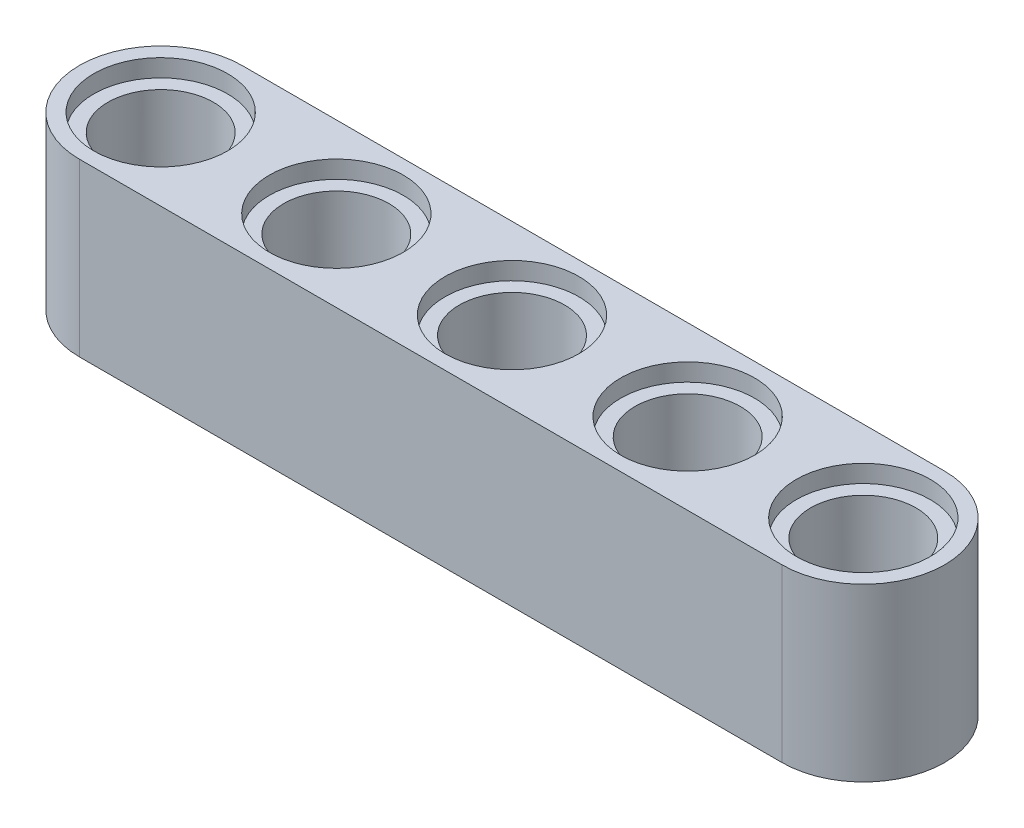
ISO-10303-21;
HEADER;
FILE_DESCRIPTION(('STEP AP214'),'2;1');
FILE_NAME('part.step','',(''),(''),'','','');
FILE_SCHEMA(('AUTOMOTIVE_DESIGN { 1 0 10303 214 1 1 1 1 }'));
ENDSEC;
DATA;
#1=APPLICATION_CONTEXT('core data for automotive mechanical design processes');
#2=APPLICATION_PROTOCOL_DEFINITION('international standard','automotive_design',2000,#1);
#3=PRODUCT_CONTEXT('',#1,'mechanical');
#4=PRODUCT('Part','Part','',(#3));
#5=PRODUCT_RELATED_PRODUCT_CATEGORY('part','',(#4));
#6=PRODUCT_DEFINITION_FORMATION('','',#4);
#7=PRODUCT_DEFINITION_CONTEXT('part definition',#1,'design');
#8=PRODUCT_DEFINITION('design','',#6,#7);
#9=PRODUCT_DEFINITION_SHAPE('','',#8);
#10=(LENGTH_UNIT() NAMED_UNIT(*) SI_UNIT(.MILLI.,.METRE.));
#11=(NAMED_UNIT(*) PLANE_ANGLE_UNIT() SI_UNIT($,.RADIAN.));
#12=(NAMED_UNIT(*) SI_UNIT($,.STERADIAN.) SOLID_ANGLE_UNIT());
#13=UNCERTAINTY_MEASURE_WITH_UNIT(LENGTH_MEASURE(1.E-05),#10,'distance_accuracy_value','');
#14=(GEOMETRIC_REPRESENTATION_CONTEXT(3) GLOBAL_UNCERTAINTY_ASSIGNED_CONTEXT((#13)) GLOBAL_UNIT_ASSIGNED_CONTEXT((#10,
#11,#12)) REPRESENTATION_CONTEXT('',''));
#15=CARTESIAN_POINT('',(0.,0.,0.));
#16=DIRECTION('',(0.,0.,1.));
#17=DIRECTION('',(1.,0.,0.));
#18=AXIS2_PLACEMENT_3D('',#15,#16,#17);
#19=CARTESIAN_POINT('',(8.,0.,0.));
#20=DIRECTION('',(0.,1.,0.));
#21=DIRECTION('',(0.,0.,1.));
#22=AXIS2_PLACEMENT_3D('',#19,#20,#21);
#23=CYLINDRICAL_SURFACE('',#22,2.4);
#24=CARTESIAN_POINT('',(8.,7.,0.));
#25=DIRECTION('',(0.,1.,0.));
#26=DIRECTION('',(0.,0.,1.));
#27=AXIS2_PLACEMENT_3D('',#24,#25,#26);
#28=CIRCLE('',#27,2.4);
#29=CARTESIAN_POINT('',(8.,7.,2.4));
#30=VERTEX_POINT('',#29);
#31=EDGE_CURVE('E123',#30,#30,#28,.F.);
#32=ORIENTED_EDGE('',*,*,#31,.F.);
#33=EDGE_LOOP('',(#32));
#34=FACE_BOUND('',#33,.T.);
#35=CARTESIAN_POINT('',(8.,0.8,0.));
#36=DIRECTION('',(0.,-1.,0.));
#37=DIRECTION('',(0.,0.,-1.));
#38=AXIS2_PLACEMENT_3D('',#35,#36,#37);
#39=CIRCLE('',#38,2.4);
#40=CARTESIAN_POINT('',(8.,0.8,-2.4));
#41=VERTEX_POINT('',#40);
#42=EDGE_CURVE('E40',#41,#41,#39,.F.);
#43=ORIENTED_EDGE('',*,*,#42,.F.);
#44=EDGE_LOOP('',(#43));
#45=FACE_BOUND('',#44,.T.);
#46=ADVANCED_FACE('F36',(#34,#45),#23,.F.);
#47=CARTESIAN_POINT('',(0.,0.,0.));
#48=DIRECTION('',(0.,1.,0.));
#49=DIRECTION('',(0.,0.,1.));
#50=AXIS2_PLACEMENT_3D('',#47,#48,#49);
#51=CYLINDRICAL_SURFACE('',#50,2.4);
#52=CARTESIAN_POINT('',(0.,7.,0.));
#53=DIRECTION('',(0.,1.,0.));
#54=DIRECTION('',(0.,0.,1.));
#55=AXIS2_PLACEMENT_3D('',#52,#53,#54);
#56=CIRCLE('',#55,2.4);
#57=CARTESIAN_POINT('',(0.,7.,2.4));
#58=VERTEX_POINT('',#57);
#59=EDGE_CURVE('E120',#58,#58,#56,.F.);
#60=ORIENTED_EDGE('',*,*,#59,.F.);
#61=EDGE_LOOP('',(#60));
#62=FACE_BOUND('',#61,.T.);
#63=CARTESIAN_POINT('',(0.,0.8,0.));
#64=DIRECTION('',(0.,-1.,0.));
#65=DIRECTION('',(0.,0.,-1.));
#66=AXIS2_PLACEMENT_3D('',#63,#64,#65);
#67=CIRCLE('',#66,2.4);
#68=CARTESIAN_POINT('',(0.,0.8,-2.4));
#69=VERTEX_POINT('',#68);
#70=EDGE_CURVE('E137',#69,#69,#67,.F.);
#71=ORIENTED_EDGE('',*,*,#70,.F.);
#72=EDGE_LOOP('',(#71));
#73=FACE_BOUND('',#72,.T.);
#74=ADVANCED_FACE('F214',(#62,#73),#51,.F.);
#75=CARTESIAN_POINT('',(-16.,0.,0.));
#76=DIRECTION('',(0.,1.,0.));
#77=DIRECTION('',(0.,0.,1.));
#78=AXIS2_PLACEMENT_3D('',#75,#76,#77);
#79=CYLINDRICAL_SURFACE('',#78,2.4);
#80=CARTESIAN_POINT('',(-16.,7.,0.));
#81=DIRECTION('',(0.,1.,0.));
#82=DIRECTION('',(0.,0.,1.));
#83=AXIS2_PLACEMENT_3D('',#80,#81,#82);
#84=CIRCLE('',#83,2.4);
#85=CARTESIAN_POINT('',(-16.,7.,2.4));
#86=VERTEX_POINT('',#85);
#87=EDGE_CURVE('E113',#86,#86,#84,.F.);
#88=ORIENTED_EDGE('',*,*,#87,.F.);
#89=EDGE_LOOP('',(#88));
#90=FACE_BOUND('',#89,.T.);
#91=CARTESIAN_POINT('',(-16.,0.8,0.));
#92=DIRECTION('',(0.,-1.,0.));
#93=DIRECTION('',(0.,0.,-1.));
#94=AXIS2_PLACEMENT_3D('',#91,#92,#93);
#95=CIRCLE('',#94,2.4);
#96=CARTESIAN_POINT('',(-16.,0.8,-2.4));
#97=VERTEX_POINT('',#96);
#98=EDGE_CURVE('E135',#97,#97,#95,.F.);
#99=ORIENTED_EDGE('',*,*,#98,.F.);
#100=EDGE_LOOP('',(#99));
#101=FACE_BOUND('',#100,.T.);
#102=ADVANCED_FACE('F189',(#90,#101),#79,.F.);
#103=CARTESIAN_POINT('',(16.,7.8,0.));
#104=DIRECTION('',(0.,-1.,0.));
#105=DIRECTION('',(0.,0.,-1.));
#106=AXIS2_PLACEMENT_3D('',#103,#104,#105);
#107=PLANE('',#106);
#108=CARTESIAN_POINT('',(-8.,7.8,0.));
#109=DIRECTION('',(0.,1.,0.));
#110=DIRECTION('',(0.,0.,-1.));
#111=AXIS2_PLACEMENT_3D('',#108,#109,#110);
#112=CIRCLE('',#111,3.05);
#113=CARTESIAN_POINT('',(-8.,7.8,-3.05));
#114=VERTEX_POINT('',#113);
#115=EDGE_CURVE('E142',#114,#114,#112,.T.);
#116=ORIENTED_EDGE('',*,*,#115,.F.);
#117=EDGE_LOOP('',(#116));
#118=FACE_BOUND('',#117,.T.);
#119=CARTESIAN_POINT('',(-16.,7.8,0.));
#120=DIRECTION('',(0.,1.,0.));
#121=DIRECTION('',(0.,0.,1.));
#122=AXIS2_PLACEMENT_3D('',#119,#120,#121);
#123=CIRCLE('',#122,3.05);
#124=CARTESIAN_POINT('',(-16.,7.8,3.05));
#125=VERTEX_POINT('',#124);
#126=EDGE_CURVE('E151',#125,#125,#123,.T.);
#127=ORIENTED_EDGE('',*,*,#126,.F.);
#128=EDGE_LOOP('',(#127));
#129=FACE_BOUND('',#128,.T.);
#130=CARTESIAN_POINT('',(16.,7.8,0.));
#131=DIRECTION('',(0.,1.,0.));
#132=DIRECTION('',(0.,0.,-1.));
#133=AXIS2_PLACEMENT_3D('',#130,#131,#132);
#134=CIRCLE('',#133,3.05);
#135=CARTESIAN_POINT('',(16.,7.8,-3.05));
#136=VERTEX_POINT('',#135);
#137=EDGE_CURVE('E176',#136,#136,#134,.T.);
#138=ORIENTED_EDGE('',*,*,#137,.F.);
#139=EDGE_LOOP('',(#138));
#140=FACE_BOUND('',#139,.T.);
#141=CARTESIAN_POINT('',(0.,7.8,0.));
#142=DIRECTION('',(0.,1.,0.));
#143=DIRECTION('',(0.,0.,1.));
#144=AXIS2_PLACEMENT_3D('',#141,#142,#143);
#145=CIRCLE('',#144,3.05);
#146=CARTESIAN_POINT('',(0.,7.8,3.05));
#147=VERTEX_POINT('',#146);
#148=EDGE_CURVE('E163',#147,#147,#145,.T.);
#149=ORIENTED_EDGE('',*,*,#148,.F.);
#150=EDGE_LOOP('',(#149));
#151=FACE_BOUND('',#150,.T.);
#152=CARTESIAN_POINT('',(8.,7.8,0.));
#153=DIRECTION('',(0.,1.,0.));
#154=DIRECTION('',(0.,0.,1.));
#155=AXIS2_PLACEMENT_3D('',#152,#153,#154);
#156=CIRCLE('',#155,3.05);
#157=CARTESIAN_POINT('',(8.,7.8,3.05));
#158=VERTEX_POINT('',#157);
#159=EDGE_CURVE('E157',#158,#158,#156,.T.);
#160=ORIENTED_EDGE('',*,*,#159,.F.);
#161=EDGE_LOOP('',(#160));
#162=FACE_BOUND('',#161,.T.);
#163=DIRECTION('',(1.,0.,0.));
#164=VECTOR('',#163,1.);
#165=CARTESIAN_POINT('',(0.,7.8,3.7));
#166=LINE('',#165,#164);
#167=CARTESIAN_POINT('',(-16.,7.8,3.7));
#168=VERTEX_POINT('',#167);
#169=CARTESIAN_POINT('',(16.,7.8,3.7));
#170=VERTEX_POINT('',#169);
#171=EDGE_CURVE('E55',#168,#170,#166,.T.);
#172=ORIENTED_EDGE('',*,*,#171,.T.);
#173=CARTESIAN_POINT('',(16.,7.8,0.));
#174=DIRECTION('',(0.,-1.,0.));
#175=DIRECTION('',(0.,0.,-1.));
#176=AXIS2_PLACEMENT_3D('',#173,#174,#175);
#177=CIRCLE('',#176,3.7);
#178=CARTESIAN_POINT('',(16.,7.8,-3.7));
#179=VERTEX_POINT('',#178);
#180=EDGE_CURVE('E84',#179,#170,#177,.T.);
#181=ORIENTED_EDGE('',*,*,#180,.F.);
#182=DIRECTION('',(1.,0.,0.));
#183=VECTOR('',#182,1.);
#184=CARTESIAN_POINT('',(-16.,7.8,-3.7));
#185=LINE('',#184,#183);
#186=CARTESIAN_POINT('',(-16.,7.8,-3.7));
#187=VERTEX_POINT('',#186);
#188=EDGE_CURVE('E94',#187,#179,#185,.T.);
#189=ORIENTED_EDGE('',*,*,#188,.F.);
#190=CARTESIAN_POINT('',(-16.,7.8,0.));
#191=DIRECTION('',(0.,1.,0.));
#192=DIRECTION('',(0.,0.,1.));
#193=AXIS2_PLACEMENT_3D('',#190,#191,#192);
#194=CIRCLE('',#193,3.7);
#195=EDGE_CURVE('E97',#187,#168,#194,.T.);
#196=ORIENTED_EDGE('',*,*,#195,.T.);
#197=EDGE_LOOP('',(#172,#181,#189,#196));
#198=FACE_BOUND('',#197,.T.);
#199=ADVANCED_FACE('F93',(#118,#129,#140,#151,#162,#198),#107,.F.);
#200=CARTESIAN_POINT('',(16.,0.,0.));
#201=DIRECTION('',(0.,-1.,0.));
#202=DIRECTION('',(0.,0.,-1.));
#203=AXIS2_PLACEMENT_3D('',#200,#201,#202);
#204=PLANE('',#203);
#205=CARTESIAN_POINT('',(-8.,0.,0.));
#206=DIRECTION('',(0.,-1.,0.));
#207=DIRECTION('',(0.,0.,1.));
#208=AXIS2_PLACEMENT_3D('',#205,#206,#207);
#209=CIRCLE('',#208,3.05);
#210=CARTESIAN_POINT('',(-8.,0.,3.05));
#211=VERTEX_POINT('',#210);
#212=EDGE_CURVE('E506',#211,#211,#209,.T.);
#213=ORIENTED_EDGE('',*,*,#212,.F.);
#214=EDGE_LOOP('',(#213));
#215=FACE_BOUND('',#214,.T.);
#216=CARTESIAN_POINT('',(-16.,0.,0.));
#217=DIRECTION('',(0.,-1.,0.));
#218=DIRECTION('',(0.,0.,-1.));
#219=AXIS2_PLACEMENT_3D('',#216,#217,#218);
#220=CIRCLE('',#219,3.05);
#221=CARTESIAN_POINT('',(-16.,0.,-3.05));
#222=VERTEX_POINT('',#221);
#223=EDGE_CURVE('E499',#222,#222,#220,.T.);
#224=ORIENTED_EDGE('',*,*,#223,.F.);
#225=EDGE_LOOP('',(#224));
#226=FACE_BOUND('',#225,.T.);
#227=CARTESIAN_POINT('',(16.,0.,0.));
#228=DIRECTION('',(0.,-1.,0.));
#229=DIRECTION('',(0.,0.,1.));
#230=AXIS2_PLACEMENT_3D('',#227,#228,#229);
#231=CIRCLE('',#230,3.05);
#232=CARTESIAN_POINT('',(16.,0.,3.05));
#233=VERTEX_POINT('',#232);
#234=EDGE_CURVE('E503',#233,#233,#231,.T.);
#235=ORIENTED_EDGE('',*,*,#234,.F.);
#236=EDGE_LOOP('',(#235));
#237=FACE_BOUND('',#236,.T.);
#238=CARTESIAN_POINT('',(0.,0.,0.));
#239=DIRECTION('',(0.,-1.,0.));
#240=DIRECTION('',(0.,0.,-1.));
#241=AXIS2_PLACEMENT_3D('',#238,#239,#240);
#242=CIRCLE('',#241,3.05);
#243=CARTESIAN_POINT('',(0.,0.,-3.05));
#244=VERTEX_POINT('',#243);
#245=EDGE_CURVE('E518',#244,#244,#242,.T.);
#246=ORIENTED_EDGE('',*,*,#245,.F.);
#247=EDGE_LOOP('',(#246));
#248=FACE_BOUND('',#247,.T.);
#249=CARTESIAN_POINT('',(8.,0.,0.));
#250=DIRECTION('',(0.,-1.,0.));
#251=DIRECTION('',(0.,0.,-1.));
#252=AXIS2_PLACEMENT_3D('',#249,#250,#251);
#253=CIRCLE('',#252,3.05);
#254=CARTESIAN_POINT('',(8.,0.,-3.05));
#255=VERTEX_POINT('',#254);
#256=EDGE_CURVE('E171',#255,#255,#253,.T.);
#257=ORIENTED_EDGE('',*,*,#256,.F.);
#258=EDGE_LOOP('',(#257));
#259=FACE_BOUND('',#258,.T.);
#260=CARTESIAN_POINT('',(16.,0.,0.));
#261=DIRECTION('',(0.,-1.,0.));
#262=DIRECTION('',(0.,0.,-1.));
#263=AXIS2_PLACEMENT_3D('',#260,#261,#262);
#264=CIRCLE('',#263,3.7);
#265=CARTESIAN_POINT('',(16.,0.,-3.7));
#266=VERTEX_POINT('',#265);
#267=CARTESIAN_POINT('',(16.,0.,3.7));
#268=VERTEX_POINT('',#267);
#269=EDGE_CURVE('E86',#266,#268,#264,.T.);
#270=ORIENTED_EDGE('',*,*,#269,.T.);
#271=DIRECTION('',(-1.,0.,0.));
#272=VECTOR('',#271,1.);
#273=CARTESIAN_POINT('',(0.,0.,3.7));
#274=LINE('',#273,#272);
#275=CARTESIAN_POINT('',(-16.,0.,3.7));
#276=VERTEX_POINT('',#275);
#277=EDGE_CURVE('E108',#268,#276,#274,.T.);
#278=ORIENTED_EDGE('',*,*,#277,.T.);
#279=CARTESIAN_POINT('',(-16.,0.,0.));
#280=DIRECTION('',(0.,1.,0.));
#281=DIRECTION('',(0.,0.,1.));
#282=AXIS2_PLACEMENT_3D('',#279,#280,#281);
#283=CIRCLE('',#282,3.7);
#284=CARTESIAN_POINT('',(-16.,0.,-3.7));
#285=VERTEX_POINT('',#284);
#286=EDGE_CURVE('E106',#285,#276,#283,.T.);
#287=ORIENTED_EDGE('',*,*,#286,.F.);
#288=DIRECTION('',(1.,0.,0.));
#289=VECTOR('',#288,1.);
#290=CARTESIAN_POINT('',(-16.,0.,-3.7));
#291=LINE('',#290,#289);
#292=EDGE_CURVE('E103',#285,#266,#291,.T.);
#293=ORIENTED_EDGE('',*,*,#292,.T.);
#294=EDGE_LOOP('',(#270,#278,#287,#293));
#295=FACE_BOUND('',#294,.T.);
#296=ADVANCED_FACE('F188',(#215,#226,#237,#248,#259,#295),#204,.T.);
#297=CARTESIAN_POINT('',(16.,7.8,0.));
#298=DIRECTION('',(0.,-1.,0.));
#299=DIRECTION('',(0.,0.,-1.));
#300=AXIS2_PLACEMENT_3D('',#297,#298,#299);
#301=CYLINDRICAL_SURFACE('',#300,3.7);
#302=ORIENTED_EDGE('',*,*,#269,.F.);
#303=DIRECTION('',(0.,-1.,0.));
#304=VECTOR('',#303,1.);
#305=CARTESIAN_POINT('',(16.,7.8,-3.7));
#306=LINE('',#305,#304);
#307=EDGE_CURVE('E46',#179,#266,#306,.T.);
#308=ORIENTED_EDGE('',*,*,#307,.F.);
#309=ORIENTED_EDGE('',*,*,#180,.T.);
#310=DIRECTION('',(0.,-1.,0.));
#311=VECTOR('',#310,1.);
#312=CARTESIAN_POINT('',(16.,7.8,3.7));
#313=LINE('',#312,#311);
#314=EDGE_CURVE('E11',#170,#268,#313,.T.);
#315=ORIENTED_EDGE('',*,*,#314,.T.);
#316=EDGE_LOOP('',(#302,#308,#309,#315));
#317=FACE_BOUND('',#316,.T.);
#318=ADVANCED_FACE('F38',(#317),#301,.T.);
#319=CARTESIAN_POINT('',(-16.,7.8,-3.7));
#320=DIRECTION('',(0.,0.,-1.));
#321=DIRECTION('',(-1.,0.,0.));
#322=AXIS2_PLACEMENT_3D('',#319,#320,#321);
#323=PLANE('',#322);
#324=ORIENTED_EDGE('',*,*,#292,.F.);
#325=DIRECTION('',(0.,-1.,0.));
#326=VECTOR('',#325,1.);
#327=CARTESIAN_POINT('',(-16.,7.8,-3.7));
#328=LINE('',#327,#326);
#329=EDGE_CURVE('E72',#187,#285,#328,.T.);
#330=ORIENTED_EDGE('',*,*,#329,.F.);
#331=ORIENTED_EDGE('',*,*,#188,.T.);
#332=ORIENTED_EDGE('',*,*,#307,.T.);
#333=EDGE_LOOP('',(#324,#330,#331,#332));
#334=FACE_BOUND('',#333,.T.);
#335=ADVANCED_FACE('F96',(#334),#323,.T.);
#336=CARTESIAN_POINT('',(-16.,7.8,0.));
#337=DIRECTION('',(0.,-1.,0.));
#338=DIRECTION('',(0.,0.,-1.));
#339=AXIS2_PLACEMENT_3D('',#336,#337,#338);
#340=CYLINDRICAL_SURFACE('',#339,3.7);
#341=ORIENTED_EDGE('',*,*,#286,.T.);
#342=DIRECTION('',(0.,-1.,0.));
#343=VECTOR('',#342,1.);
#344=CARTESIAN_POINT('',(-16.,7.8,3.7));
#345=LINE('',#344,#343);
#346=EDGE_CURVE('E76',#168,#276,#345,.T.);
#347=ORIENTED_EDGE('',*,*,#346,.F.);
#348=ORIENTED_EDGE('',*,*,#195,.F.);
#349=ORIENTED_EDGE('',*,*,#329,.T.);
#350=EDGE_LOOP('',(#341,#347,#348,#349));
#351=FACE_BOUND('',#350,.T.);
#352=ADVANCED_FACE('F237',(#351),#340,.T.);
#353=CARTESIAN_POINT('',(0.,7.8,3.7));
#354=DIRECTION('',(0.,0.,1.));
#355=DIRECTION('',(1.,0.,0.));
#356=AXIS2_PLACEMENT_3D('',#353,#354,#355);
#357=PLANE('',#356);
#358=ORIENTED_EDGE('',*,*,#277,.F.);
#359=ORIENTED_EDGE('',*,*,#314,.F.);
#360=ORIENTED_EDGE('',*,*,#171,.F.);
#361=ORIENTED_EDGE('',*,*,#346,.T.);
#362=EDGE_LOOP('',(#358,#359,#360,#361));
#363=FACE_BOUND('',#362,.T.);
#364=ADVANCED_FACE('F229',(#363),#357,.T.);
#365=CARTESIAN_POINT('',(16.,0.,0.));
#366=DIRECTION('',(0.,1.,0.));
#367=DIRECTION('',(0.,0.,1.));
#368=AXIS2_PLACEMENT_3D('',#365,#366,#367);
#369=CYLINDRICAL_SURFACE('',#368,2.4);
#370=CARTESIAN_POINT('',(16.,0.8,0.));
#371=DIRECTION('',(0.,1.,0.));
#372=DIRECTION('',(0.,0.,1.));
#373=AXIS2_PLACEMENT_3D('',#370,#371,#372);
#374=CIRCLE('',#373,2.4);
#375=CARTESIAN_POINT('',(16.,0.8,2.4));
#376=VERTEX_POINT('',#375);
#377=EDGE_CURVE('E131',#376,#376,#374,.T.);
#378=ORIENTED_EDGE('',*,*,#377,.F.);
#379=EDGE_LOOP('',(#378));
#380=FACE_BOUND('',#379,.T.);
#381=CARTESIAN_POINT('',(16.,7.,0.));
#382=DIRECTION('',(0.,-1.,0.));
#383=DIRECTION('',(0.,0.,-1.));
#384=AXIS2_PLACEMENT_3D('',#381,#382,#383);
#385=CIRCLE('',#384,2.4);
#386=CARTESIAN_POINT('',(16.,7.,-2.4));
#387=VERTEX_POINT('',#386);
#388=EDGE_CURVE('E104',#387,#387,#385,.T.);
#389=ORIENTED_EDGE('',*,*,#388,.F.);
#390=EDGE_LOOP('',(#389));
#391=FACE_BOUND('',#390,.T.);
#392=ADVANCED_FACE('F226',(#380,#391),#369,.F.);
#393=CARTESIAN_POINT('',(-8.,0.,0.));
#394=DIRECTION('',(0.,1.,0.));
#395=DIRECTION('',(0.,0.,1.));
#396=AXIS2_PLACEMENT_3D('',#393,#394,#395);
#397=CYLINDRICAL_SURFACE('',#396,2.4);
#398=CARTESIAN_POINT('',(-8.,0.8,0.));
#399=DIRECTION('',(0.,1.,0.));
#400=DIRECTION('',(0.,0.,1.));
#401=AXIS2_PLACEMENT_3D('',#398,#399,#400);
#402=CIRCLE('',#401,2.4);
#403=CARTESIAN_POINT('',(-8.,0.8,2.4));
#404=VERTEX_POINT('',#403);
#405=EDGE_CURVE('E128',#404,#404,#402,.T.);
#406=ORIENTED_EDGE('',*,*,#405,.F.);
#407=EDGE_LOOP('',(#406));
#408=FACE_BOUND('',#407,.T.);
#409=CARTESIAN_POINT('',(-8.,7.,0.));
#410=DIRECTION('',(0.,-1.,0.));
#411=DIRECTION('',(0.,0.,-1.));
#412=AXIS2_PLACEMENT_3D('',#409,#410,#411);
#413=CIRCLE('',#412,2.4);
#414=CARTESIAN_POINT('',(-8.,7.,-2.4));
#415=VERTEX_POINT('',#414);
#416=EDGE_CURVE('E116',#415,#415,#413,.T.);
#417=ORIENTED_EDGE('',*,*,#416,.F.);
#418=EDGE_LOOP('',(#417));
#419=FACE_BOUND('',#418,.T.);
#420=ADVANCED_FACE('F228',(#408,#419),#397,.F.);
#421=CARTESIAN_POINT('',(-16.,7.,0.));
#422=DIRECTION('',(0.,1.,0.));
#423=DIRECTION('',(0.,0.,1.));
#424=AXIS2_PLACEMENT_3D('',#421,#422,#423);
#425=PLANE('',#424);
#426=CARTESIAN_POINT('',(-16.,7.,0.));
#427=DIRECTION('',(0.,1.,0.));
#428=DIRECTION('',(0.,0.,1.));
#429=AXIS2_PLACEMENT_3D('',#426,#427,#428);
#430=CIRCLE('',#429,3.05);
#431=CARTESIAN_POINT('',(-16.,7.,3.05));
#432=VERTEX_POINT('',#431);
#433=EDGE_CURVE('E179',#432,#432,#430,.T.);
#434=ORIENTED_EDGE('',*,*,#433,.T.);
#435=EDGE_LOOP('',(#434));
#436=FACE_BOUND('',#435,.T.);
#437=ORIENTED_EDGE('',*,*,#87,.T.);
#438=EDGE_LOOP('',(#437));
#439=FACE_BOUND('',#438,.T.);
#440=ADVANCED_FACE('F345',(#436,#439),#425,.T.);
#441=CARTESIAN_POINT('',(-16.,7.,0.));
#442=DIRECTION('',(0.,1.,0.));
#443=DIRECTION('',(0.,0.,1.));
#444=AXIS2_PLACEMENT_3D('',#441,#442,#443);
#445=CYLINDRICAL_SURFACE('',#444,3.05);
#446=ORIENTED_EDGE('',*,*,#433,.F.);
#447=EDGE_LOOP('',(#446));
#448=FACE_BOUND('',#447,.T.);
#449=ORIENTED_EDGE('',*,*,#126,.T.);
#450=EDGE_LOOP('',(#449));
#451=FACE_BOUND('',#450,.T.);
#452=ADVANCED_FACE('F184',(#448,#451),#445,.F.);
#453=CARTESIAN_POINT('',(-8.,7.,0.));
#454=DIRECTION('',(0.,1.,0.));
#455=DIRECTION('',(0.,0.,1.));
#456=AXIS2_PLACEMENT_3D('',#453,#454,#455);
#457=CYLINDRICAL_SURFACE('',#456,3.05);
#458=CARTESIAN_POINT('',(-8.,7.,0.));
#459=DIRECTION('',(0.,1.,0.));
#460=DIRECTION('',(0.,0.,-1.));
#461=AXIS2_PLACEMENT_3D('',#458,#459,#460);
#462=CIRCLE('',#461,3.05);
#463=CARTESIAN_POINT('',(-8.,7.,-3.05));
#464=VERTEX_POINT('',#463);
#465=EDGE_CURVE('E146',#464,#464,#462,.T.);
#466=ORIENTED_EDGE('',*,*,#465,.F.);
#467=EDGE_LOOP('',(#466));
#468=FACE_BOUND('',#467,.T.);
#469=ORIENTED_EDGE('',*,*,#115,.T.);
#470=EDGE_LOOP('',(#469));
#471=FACE_BOUND('',#470,.T.);
#472=ADVANCED_FACE('F327',(#468,#471),#457,.F.);
#473=CARTESIAN_POINT('',(-8.,7.,0.));
#474=DIRECTION('',(0.,-1.,0.));
#475=DIRECTION('',(0.,0.,-1.));
#476=AXIS2_PLACEMENT_3D('',#473,#474,#475);
#477=PLANE('',#476);
#478=ORIENTED_EDGE('',*,*,#416,.T.);
#479=EDGE_LOOP('',(#478));
#480=FACE_BOUND('',#479,.T.);
#481=ORIENTED_EDGE('',*,*,#465,.T.);
#482=EDGE_LOOP('',(#481));
#483=FACE_BOUND('',#482,.T.);
#484=ADVANCED_FACE('F210',(#480,#483),#477,.F.);
#485=CARTESIAN_POINT('',(0.,7.,0.));
#486=DIRECTION('',(0.,1.,0.));
#487=DIRECTION('',(0.,0.,1.));
#488=AXIS2_PLACEMENT_3D('',#485,#486,#487);
#489=PLANE('',#488);
#490=CARTESIAN_POINT('',(0.,7.,0.));
#491=DIRECTION('',(0.,1.,0.));
#492=DIRECTION('',(0.,0.,1.));
#493=AXIS2_PLACEMENT_3D('',#490,#491,#492);
#494=CIRCLE('',#493,3.05);
#495=CARTESIAN_POINT('',(0.,7.,3.05));
#496=VERTEX_POINT('',#495);
#497=EDGE_CURVE('E159',#496,#496,#494,.T.);
#498=ORIENTED_EDGE('',*,*,#497,.T.);
#499=EDGE_LOOP('',(#498));
#500=FACE_BOUND('',#499,.T.);
#501=ORIENTED_EDGE('',*,*,#59,.T.);
#502=EDGE_LOOP('',(#501));
#503=FACE_BOUND('',#502,.T.);
#504=ADVANCED_FACE('F200',(#500,#503),#489,.T.);
#505=CARTESIAN_POINT('',(0.,7.,0.));
#506=DIRECTION('',(0.,1.,0.));
#507=DIRECTION('',(0.,0.,1.));
#508=AXIS2_PLACEMENT_3D('',#505,#506,#507);
#509=CYLINDRICAL_SURFACE('',#508,3.05);
#510=ORIENTED_EDGE('',*,*,#497,.F.);
#511=EDGE_LOOP('',(#510));
#512=FACE_BOUND('',#511,.T.);
#513=ORIENTED_EDGE('',*,*,#148,.T.);
#514=EDGE_LOOP('',(#513));
#515=FACE_BOUND('',#514,.T.);
#516=ADVANCED_FACE('F197',(#512,#515),#509,.F.);
#517=CARTESIAN_POINT('',(8.,7.,0.));
#518=DIRECTION('',(0.,1.,0.));
#519=DIRECTION('',(0.,0.,1.));
#520=AXIS2_PLACEMENT_3D('',#517,#518,#519);
#521=PLANE('',#520);
#522=CARTESIAN_POINT('',(8.,7.,0.));
#523=DIRECTION('',(0.,1.,0.));
#524=DIRECTION('',(0.,0.,1.));
#525=AXIS2_PLACEMENT_3D('',#522,#523,#524);
#526=CIRCLE('',#525,3.05);
#527=CARTESIAN_POINT('',(8.,7.,3.05));
#528=VERTEX_POINT('',#527);
#529=EDGE_CURVE('E117',#528,#528,#526,.T.);
#530=ORIENTED_EDGE('',*,*,#529,.T.);
#531=EDGE_LOOP('',(#530));
#532=FACE_BOUND('',#531,.T.);
#533=ORIENTED_EDGE('',*,*,#31,.T.);
#534=EDGE_LOOP('',(#533));
#535=FACE_BOUND('',#534,.T.);
#536=ADVANCED_FACE('F199',(#532,#535),#521,.T.);
#537=CARTESIAN_POINT('',(8.,7.,0.));
#538=DIRECTION('',(0.,1.,0.));
#539=DIRECTION('',(0.,0.,1.));
#540=AXIS2_PLACEMENT_3D('',#537,#538,#539);
#541=CYLINDRICAL_SURFACE('',#540,3.05);
#542=ORIENTED_EDGE('',*,*,#529,.F.);
#543=EDGE_LOOP('',(#542));
#544=FACE_BOUND('',#543,.T.);
#545=ORIENTED_EDGE('',*,*,#159,.T.);
#546=EDGE_LOOP('',(#545));
#547=FACE_BOUND('',#546,.T.);
#548=ADVANCED_FACE('F207',(#544,#547),#541,.F.);
#549=CARTESIAN_POINT('',(16.,7.,0.));
#550=DIRECTION('',(0.,1.,0.));
#551=DIRECTION('',(0.,0.,1.));
#552=AXIS2_PLACEMENT_3D('',#549,#550,#551);
#553=CYLINDRICAL_SURFACE('',#552,3.05);
#554=CARTESIAN_POINT('',(16.,7.,0.));
#555=DIRECTION('',(0.,1.,0.));
#556=DIRECTION('',(0.,0.,-1.));
#557=AXIS2_PLACEMENT_3D('',#554,#555,#556);
#558=CIRCLE('',#557,3.05);
#559=CARTESIAN_POINT('',(16.,7.,-3.05));
#560=VERTEX_POINT('',#559);
#561=EDGE_CURVE('E168',#560,#560,#558,.T.);
#562=ORIENTED_EDGE('',*,*,#561,.F.);
#563=EDGE_LOOP('',(#562));
#564=FACE_BOUND('',#563,.T.);
#565=ORIENTED_EDGE('',*,*,#137,.T.);
#566=EDGE_LOOP('',(#565));
#567=FACE_BOUND('',#566,.T.);
#568=ADVANCED_FACE('F283',(#564,#567),#553,.F.);
#569=CARTESIAN_POINT('',(16.,7.,0.));
#570=DIRECTION('',(0.,-1.,0.));
#571=DIRECTION('',(0.,0.,-1.));
#572=AXIS2_PLACEMENT_3D('',#569,#570,#571);
#573=PLANE('',#572);
#574=ORIENTED_EDGE('',*,*,#388,.T.);
#575=EDGE_LOOP('',(#574));
#576=FACE_BOUND('',#575,.T.);
#577=ORIENTED_EDGE('',*,*,#561,.T.);
#578=EDGE_LOOP('',(#577));
#579=FACE_BOUND('',#578,.T.);
#580=ADVANCED_FACE('F277',(#576,#579),#573,.F.);
#581=CARTESIAN_POINT('',(-8.,0.8,0.));
#582=DIRECTION('',(0.,-1.,0.));
#583=DIRECTION('',(0.,0.,-1.));
#584=AXIS2_PLACEMENT_3D('',#581,#582,#583);
#585=CYLINDRICAL_SURFACE('',#584,3.05);
#586=CARTESIAN_POINT('',(-8.,0.8,0.));
#587=DIRECTION('',(0.,-1.,0.));
#588=DIRECTION('',(0.,0.,1.));
#589=AXIS2_PLACEMENT_3D('',#586,#587,#588);
#590=CIRCLE('',#589,3.05);
#591=CARTESIAN_POINT('',(-8.,0.8,3.05));
#592=VERTEX_POINT('',#591);
#593=EDGE_CURVE('E501',#592,#592,#590,.T.);
#594=ORIENTED_EDGE('',*,*,#593,.F.);
#595=EDGE_LOOP('',(#594));
#596=FACE_BOUND('',#595,.T.);
#597=ORIENTED_EDGE('',*,*,#212,.T.);
#598=EDGE_LOOP('',(#597));
#599=FACE_BOUND('',#598,.T.);
#600=ADVANCED_FACE('F282',(#596,#599),#585,.F.);
#601=CARTESIAN_POINT('',(-8.,0.8,0.));
#602=DIRECTION('',(0.,1.,0.));
#603=DIRECTION('',(0.,0.,1.));
#604=AXIS2_PLACEMENT_3D('',#601,#602,#603);
#605=PLANE('',#604);
#606=ORIENTED_EDGE('',*,*,#405,.T.);
#607=EDGE_LOOP('',(#606));
#608=FACE_BOUND('',#607,.T.);
#609=ORIENTED_EDGE('',*,*,#593,.T.);
#610=EDGE_LOOP('',(#609));
#611=FACE_BOUND('',#610,.T.);
#612=ADVANCED_FACE('F399',(#608,#611),#605,.F.);
#613=CARTESIAN_POINT('',(16.,0.8,0.));
#614=DIRECTION('',(0.,-1.,0.));
#615=DIRECTION('',(0.,0.,-1.));
#616=AXIS2_PLACEMENT_3D('',#613,#614,#615);
#617=CYLINDRICAL_SURFACE('',#616,3.05);
#618=CARTESIAN_POINT('',(16.,0.8,0.));
#619=DIRECTION('',(0.,-1.,0.));
#620=DIRECTION('',(0.,0.,1.));
#621=AXIS2_PLACEMENT_3D('',#618,#619,#620);
#622=CIRCLE('',#621,3.05);
#623=CARTESIAN_POINT('',(16.,0.8,3.05));
#624=VERTEX_POINT('',#623);
#625=EDGE_CURVE('E522',#624,#624,#622,.T.);
#626=ORIENTED_EDGE('',*,*,#625,.F.);
#627=EDGE_LOOP('',(#626));
#628=FACE_BOUND('',#627,.T.);
#629=ORIENTED_EDGE('',*,*,#234,.T.);
#630=EDGE_LOOP('',(#629));
#631=FACE_BOUND('',#630,.T.);
#632=ADVANCED_FACE('F409',(#628,#631),#617,.F.);
#633=CARTESIAN_POINT('',(16.,0.8,0.));
#634=DIRECTION('',(0.,1.,0.));
#635=DIRECTION('',(0.,0.,1.));
#636=AXIS2_PLACEMENT_3D('',#633,#634,#635);
#637=PLANE('',#636);
#638=ORIENTED_EDGE('',*,*,#377,.T.);
#639=EDGE_LOOP('',(#638));
#640=FACE_BOUND('',#639,.T.);
#641=ORIENTED_EDGE('',*,*,#625,.T.);
#642=EDGE_LOOP('',(#641));
#643=FACE_BOUND('',#642,.T.);
#644=ADVANCED_FACE('F419',(#640,#643),#637,.F.);
#645=CARTESIAN_POINT('',(8.,0.8,0.));
#646=DIRECTION('',(0.,-1.,0.));
#647=DIRECTION('',(0.,0.,-1.));
#648=AXIS2_PLACEMENT_3D('',#645,#646,#647);
#649=PLANE('',#648);
#650=CARTESIAN_POINT('',(8.,0.8,0.));
#651=DIRECTION('',(0.,-1.,0.));
#652=DIRECTION('',(0.,0.,-1.));
#653=AXIS2_PLACEMENT_3D('',#650,#651,#652);
#654=CIRCLE('',#653,3.05);
#655=CARTESIAN_POINT('',(8.,0.8,-3.05));
#656=VERTEX_POINT('',#655);
#657=EDGE_CURVE('E132',#656,#656,#654,.T.);
#658=ORIENTED_EDGE('',*,*,#657,.T.);
#659=EDGE_LOOP('',(#658));
#660=FACE_BOUND('',#659,.T.);
#661=ORIENTED_EDGE('',*,*,#42,.T.);
#662=EDGE_LOOP('',(#661));
#663=FACE_BOUND('',#662,.T.);
#664=ADVANCED_FACE('F429',(#660,#663),#649,.T.);
#665=CARTESIAN_POINT('',(8.,0.8,0.));
#666=DIRECTION('',(0.,-1.,0.));
#667=DIRECTION('',(0.,0.,-1.));
#668=AXIS2_PLACEMENT_3D('',#665,#666,#667);
#669=CYLINDRICAL_SURFACE('',#668,3.05);
#670=ORIENTED_EDGE('',*,*,#657,.F.);
#671=EDGE_LOOP('',(#670));
#672=FACE_BOUND('',#671,.T.);
#673=ORIENTED_EDGE('',*,*,#256,.T.);
#674=EDGE_LOOP('',(#673));
#675=FACE_BOUND('',#674,.T.);
#676=ADVANCED_FACE('F439',(#672,#675),#669,.F.);
#677=CARTESIAN_POINT('',(0.,0.8,0.));
#678=DIRECTION('',(0.,-1.,0.));
#679=DIRECTION('',(0.,0.,-1.));
#680=AXIS2_PLACEMENT_3D('',#677,#678,#679);
#681=PLANE('',#680);
#682=CARTESIAN_POINT('',(0.,0.8,0.));
#683=DIRECTION('',(0.,-1.,0.));
#684=DIRECTION('',(0.,0.,-1.));
#685=AXIS2_PLACEMENT_3D('',#682,#683,#684);
#686=CIRCLE('',#685,3.05);
#687=CARTESIAN_POINT('',(0.,0.8,-3.05));
#688=VERTEX_POINT('',#687);
#689=EDGE_CURVE('E514',#688,#688,#686,.T.);
#690=ORIENTED_EDGE('',*,*,#689,.T.);
#691=EDGE_LOOP('',(#690));
#692=FACE_BOUND('',#691,.T.);
#693=ORIENTED_EDGE('',*,*,#70,.T.);
#694=EDGE_LOOP('',(#693));
#695=FACE_BOUND('',#694,.T.);
#696=ADVANCED_FACE('F449',(#692,#695),#681,.T.);
#697=CARTESIAN_POINT('',(0.,0.8,0.));
#698=DIRECTION('',(0.,-1.,0.));
#699=DIRECTION('',(0.,0.,-1.));
#700=AXIS2_PLACEMENT_3D('',#697,#698,#699);
#701=CYLINDRICAL_SURFACE('',#700,3.05);
#702=ORIENTED_EDGE('',*,*,#689,.F.);
#703=EDGE_LOOP('',(#702));
#704=FACE_BOUND('',#703,.T.);
#705=ORIENTED_EDGE('',*,*,#245,.T.);
#706=EDGE_LOOP('',(#705));
#707=FACE_BOUND('',#706,.T.);
#708=ADVANCED_FACE('F459',(#704,#707),#701,.F.);
#709=CARTESIAN_POINT('',(-16.,0.8,0.));
#710=DIRECTION('',(0.,-1.,0.));
#711=DIRECTION('',(0.,0.,-1.));
#712=AXIS2_PLACEMENT_3D('',#709,#710,#711);
#713=PLANE('',#712);
#714=CARTESIAN_POINT('',(-16.,0.8,0.));
#715=DIRECTION('',(0.,-1.,0.));
#716=DIRECTION('',(0.,0.,-1.));
#717=AXIS2_PLACEMENT_3D('',#714,#715,#716);
#718=CIRCLE('',#717,3.05);
#719=CARTESIAN_POINT('',(-16.,0.8,-3.05));
#720=VERTEX_POINT('',#719);
#721=EDGE_CURVE('E496',#720,#720,#718,.T.);
#722=ORIENTED_EDGE('',*,*,#721,.T.);
#723=EDGE_LOOP('',(#722));
#724=FACE_BOUND('',#723,.T.);
#725=ORIENTED_EDGE('',*,*,#98,.T.);
#726=EDGE_LOOP('',(#725));
#727=FACE_BOUND('',#726,.T.);
#728=ADVANCED_FACE('F469',(#724,#727),#713,.T.);
#729=CARTESIAN_POINT('',(-16.,0.8,0.));
#730=DIRECTION('',(0.,-1.,0.));
#731=DIRECTION('',(0.,0.,-1.));
#732=AXIS2_PLACEMENT_3D('',#729,#730,#731);
#733=CYLINDRICAL_SURFACE('',#732,3.05);
#734=ORIENTED_EDGE('',*,*,#721,.F.);
#735=EDGE_LOOP('',(#734));
#736=FACE_BOUND('',#735,.T.);
#737=ORIENTED_EDGE('',*,*,#223,.T.);
#738=EDGE_LOOP('',(#737));
#739=FACE_BOUND('',#738,.T.);
#740=ADVANCED_FACE('F479',(#736,#739),#733,.F.);
#741=CLOSED_SHELL('',(#46,#74,#102,#199,#296,#318,#335,#352,#364,#392,#420,#440,#452,#472,#484,
#504,#516,#536,#548,#568,#580,#600,#612,#632,#644,#664,#676,#696,#708,#728,#740));
#742=MANIFOLD_SOLID_BREP('B2',#741);
#743=ADVANCED_BREP_SHAPE_REPRESENTATION('',(#18,#742),#14);
#744=SHAPE_DEFINITION_REPRESENTATION(#9,#743);
ENDSEC;
END-ISO-10303-21;
